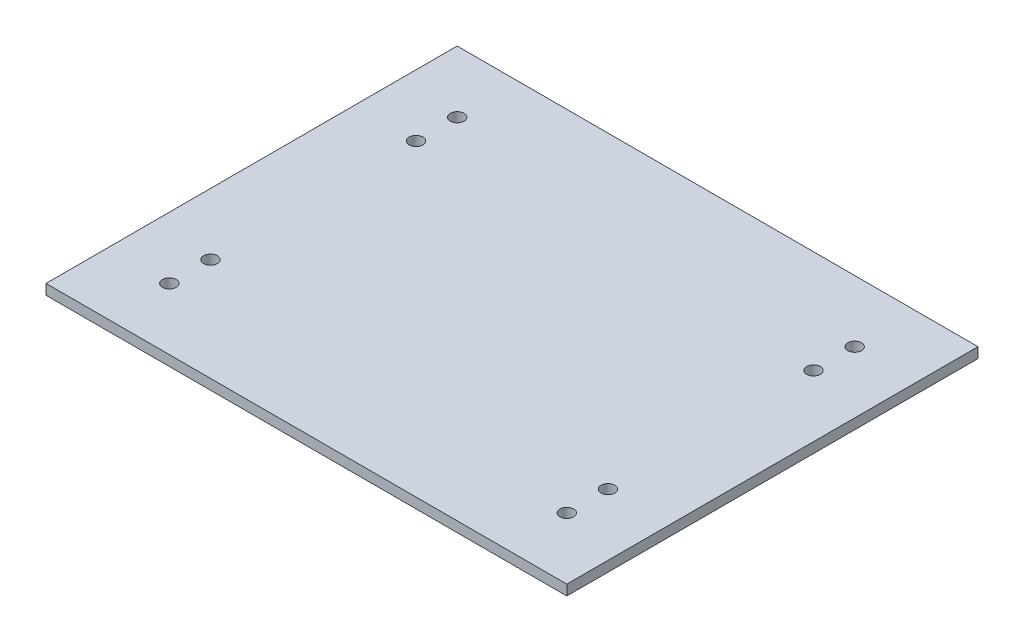
ISO-10303-21;
HEADER;
FILE_DESCRIPTION(('STEP AP214'),'2;1');
FILE_NAME('part.step','',(''),(''),'','','');
FILE_SCHEMA(('AUTOMOTIVE_DESIGN { 1 0 10303 214 1 1 1 1 }'));
ENDSEC;
DATA;
#1=APPLICATION_CONTEXT('core data for automotive mechanical design processes');
#2=APPLICATION_PROTOCOL_DEFINITION('international standard','automotive_design',2000,#1);
#3=PRODUCT_CONTEXT('',#1,'mechanical');
#4=PRODUCT('Part','Part','',(#3));
#5=PRODUCT_RELATED_PRODUCT_CATEGORY('part','',(#4));
#6=PRODUCT_DEFINITION_FORMATION('','',#4);
#7=PRODUCT_DEFINITION_CONTEXT('part definition',#1,'design');
#8=PRODUCT_DEFINITION('design','',#6,#7);
#9=PRODUCT_DEFINITION_SHAPE('','',#8);
#10=(LENGTH_UNIT() NAMED_UNIT(*) SI_UNIT(.MILLI.,.METRE.));
#11=(NAMED_UNIT(*) PLANE_ANGLE_UNIT() SI_UNIT($,.RADIAN.));
#12=(NAMED_UNIT(*) SI_UNIT($,.STERADIAN.) SOLID_ANGLE_UNIT());
#13=UNCERTAINTY_MEASURE_WITH_UNIT(LENGTH_MEASURE(1.E-05),#10,'distance_accuracy_value','');
#14=(GEOMETRIC_REPRESENTATION_CONTEXT(3) GLOBAL_UNCERTAINTY_ASSIGNED_CONTEXT((#13)) GLOBAL_UNIT_ASSIGNED_CONTEXT((#10,
#11,#12)) REPRESENTATION_CONTEXT('',''));
#15=CARTESIAN_POINT('',(0.,0.,0.));
#16=DIRECTION('',(0.,0.,1.));
#17=DIRECTION('',(1.,0.,0.));
#18=AXIS2_PLACEMENT_3D('',#15,#16,#17);
#19=CARTESIAN_POINT('',(-47.0316881728543,3.,-71.8994098232172));
#20=DIRECTION('',(1.,0.,0.));
#21=DIRECTION('',(0.,0.,-1.));
#22=AXIS2_PLACEMENT_3D('',#19,#20,#21);
#23=PLANE('',#22);
#24=DIRECTION('',(0.,0.,1.));
#25=VECTOR('',#24,1.);
#26=CARTESIAN_POINT('',(-47.0316881728543,0.,-71.8994098232172));
#27=LINE('',#26,#25);
#28=CARTESIAN_POINT('',(-47.0316881728543,0.,-71.8994098232172));
#29=VERTEX_POINT('',#28);
#30=CARTESIAN_POINT('',(-47.0316881728543,0.,48.1005901767828));
#31=VERTEX_POINT('',#30);
#32=EDGE_CURVE('E96',#29,#31,#27,.T.);
#33=ORIENTED_EDGE('',*,*,#32,.T.);
#34=DIRECTION('',(0.,-1.,0.));
#35=VECTOR('',#34,1.);
#36=CARTESIAN_POINT('',(-47.0316881728543,3.,48.1005901767828));
#37=LINE('',#36,#35);
#38=CARTESIAN_POINT('',(-47.0316881728543,3.,48.1005901767828));
#39=VERTEX_POINT('',#38);
#40=EDGE_CURVE('E11',#39,#31,#37,.T.);
#41=ORIENTED_EDGE('',*,*,#40,.F.);
#42=DIRECTION('',(0.,0.,1.));
#43=VECTOR('',#42,1.);
#44=CARTESIAN_POINT('',(-47.0316881728543,3.,-71.8994098232172));
#45=LINE('',#44,#43);
#46=CARTESIAN_POINT('',(-47.0316881728543,3.,-71.8994098232172));
#47=VERTEX_POINT('',#46);
#48=EDGE_CURVE('E84',#47,#39,#45,.T.);
#49=ORIENTED_EDGE('',*,*,#48,.F.);
#50=DIRECTION('',(0.,-1.,0.));
#51=VECTOR('',#50,1.);
#52=CARTESIAN_POINT('',(-47.0316881728543,3.,-71.8994098232172));
#53=LINE('',#52,#51);
#54=EDGE_CURVE('E92',#47,#29,#53,.T.);
#55=ORIENTED_EDGE('',*,*,#54,.T.);
#56=EDGE_LOOP('',(#33,#41,#49,#55));
#57=FACE_BOUND('',#56,.T.);
#58=ADVANCED_FACE('F33',(#57),#23,.F.);
#59=CARTESIAN_POINT('',(-47.0316881728543,3.,48.1005901767828));
#60=DIRECTION('',(0.,0.,-1.));
#61=DIRECTION('',(-1.,0.,0.));
#62=AXIS2_PLACEMENT_3D('',#59,#60,#61);
#63=PLANE('',#62);
#64=DIRECTION('',(1.,0.,0.));
#65=VECTOR('',#64,1.);
#66=CARTESIAN_POINT('',(-47.0316881728543,0.,48.1005901767828));
#67=LINE('',#66,#65);
#68=CARTESIAN_POINT('',(104.968311827146,0.,48.1005901767828));
#69=VERTEX_POINT('',#68);
#70=EDGE_CURVE('E88',#31,#69,#67,.T.);
#71=ORIENTED_EDGE('',*,*,#70,.T.);
#72=DIRECTION('',(0.,-1.,0.));
#73=VECTOR('',#72,1.);
#74=CARTESIAN_POINT('',(104.968311827146,3.,48.1005901767828));
#75=LINE('',#74,#73);
#76=CARTESIAN_POINT('',(104.968311827146,3.,48.1005901767828));
#77=VERTEX_POINT('',#76);
#78=EDGE_CURVE('E41',#77,#69,#75,.T.);
#79=ORIENTED_EDGE('',*,*,#78,.F.);
#80=DIRECTION('',(1.,0.,0.));
#81=VECTOR('',#80,1.);
#82=CARTESIAN_POINT('',(-47.0316881728543,3.,48.1005901767828));
#83=LINE('',#82,#81);
#84=EDGE_CURVE('E79',#39,#77,#83,.T.);
#85=ORIENTED_EDGE('',*,*,#84,.F.);
#86=ORIENTED_EDGE('',*,*,#40,.T.);
#87=EDGE_LOOP('',(#71,#79,#85,#86));
#88=FACE_BOUND('',#87,.T.);
#89=ADVANCED_FACE('F87',(#88),#63,.F.);
#90=CARTESIAN_POINT('',(104.968311827146,3.,-71.8994098232172));
#91=DIRECTION('',(-1.,0.,0.));
#92=DIRECTION('',(0.,0.,1.));
#93=AXIS2_PLACEMENT_3D('',#90,#91,#92);
#94=PLANE('',#93);
#95=DIRECTION('',(0.,0.,-1.));
#96=VECTOR('',#95,1.);
#97=CARTESIAN_POINT('',(104.968311827146,0.,-71.8994098232172));
#98=LINE('',#97,#96);
#99=CARTESIAN_POINT('',(104.968311827146,0.,-71.8994098232172));
#100=VERTEX_POINT('',#99);
#101=EDGE_CURVE('E66',#69,#100,#98,.T.);
#102=ORIENTED_EDGE('',*,*,#101,.T.);
#103=DIRECTION('',(0.,-1.,0.));
#104=VECTOR('',#103,1.);
#105=CARTESIAN_POINT('',(104.968311827146,3.,-71.8994098232172));
#106=LINE('',#105,#104);
#107=CARTESIAN_POINT('',(104.968311827146,3.,-71.8994098232172));
#108=VERTEX_POINT('',#107);
#109=EDGE_CURVE('E89',#108,#100,#106,.T.);
#110=ORIENTED_EDGE('',*,*,#109,.F.);
#111=DIRECTION('',(0.,0.,-1.));
#112=VECTOR('',#111,1.);
#113=CARTESIAN_POINT('',(104.968311827146,3.,-71.8994098232172));
#114=LINE('',#113,#112);
#115=EDGE_CURVE('E82',#77,#108,#114,.T.);
#116=ORIENTED_EDGE('',*,*,#115,.F.);
#117=ORIENTED_EDGE('',*,*,#78,.T.);
#118=EDGE_LOOP('',(#102,#110,#116,#117));
#119=FACE_BOUND('',#118,.T.);
#120=ADVANCED_FACE('F90',(#119),#94,.F.);
#121=CARTESIAN_POINT('',(-47.0316881728543,3.,-71.8994098232172));
#122=DIRECTION('',(0.,0.,1.));
#123=DIRECTION('',(1.,0.,0.));
#124=AXIS2_PLACEMENT_3D('',#121,#122,#123);
#125=PLANE('',#124);
#126=DIRECTION('',(-1.,0.,0.));
#127=VECTOR('',#126,1.);
#128=CARTESIAN_POINT('',(-47.0316881728543,0.,-71.8994098232172));
#129=LINE('',#128,#127);
#130=EDGE_CURVE('E72',#100,#29,#129,.T.);
#131=ORIENTED_EDGE('',*,*,#130,.T.);
#132=ORIENTED_EDGE('',*,*,#54,.F.);
#133=DIRECTION('',(-1.,0.,0.));
#134=VECTOR('',#133,1.);
#135=CARTESIAN_POINT('',(-47.0316881728543,3.,-71.8994098232172));
#136=LINE('',#135,#134);
#137=EDGE_CURVE('E49',#108,#47,#136,.T.);
#138=ORIENTED_EDGE('',*,*,#137,.F.);
#139=ORIENTED_EDGE('',*,*,#109,.T.);
#140=EDGE_LOOP('',(#131,#132,#138,#139));
#141=FACE_BOUND('',#140,.T.);
#142=ADVANCED_FACE('F104',(#141),#125,.F.);
#143=CARTESIAN_POINT('',(-47.0316881728543,3.,48.1005901767828));
#144=DIRECTION('',(0.,1.,0.));
#145=DIRECTION('',(0.,0.,1.));
#146=AXIS2_PLACEMENT_3D('',#143,#144,#145);
#147=PLANE('',#146);
#148=CARTESIAN_POINT('',(-29.0316881728543,3.,30.1005901767827));
#149=DIRECTION('',(0.,1.,0.));
#150=DIRECTION('',(0.,0.,1.));
#151=AXIS2_PLACEMENT_3D('',#148,#149,#150);
#152=CIRCLE('',#151,2.);
#153=CARTESIAN_POINT('',(-29.0316881728543,3.,32.1005901767827));
#154=VERTEX_POINT('',#153);
#155=EDGE_CURVE('E152',#154,#154,#152,.T.);
#156=ORIENTED_EDGE('',*,*,#155,.F.);
#157=EDGE_LOOP('',(#156));
#158=FACE_BOUND('',#157,.T.);
#159=CARTESIAN_POINT('',(-29.0316881728543,3.,18.1005901767828));
#160=DIRECTION('',(0.,1.,0.));
#161=DIRECTION('',(0.,0.,1.));
#162=AXIS2_PLACEMENT_3D('',#159,#160,#161);
#163=CIRCLE('',#162,2.);
#164=CARTESIAN_POINT('',(-29.0316881728543,3.,20.1005901767827));
#165=VERTEX_POINT('',#164);
#166=EDGE_CURVE('E146',#165,#165,#163,.T.);
#167=ORIENTED_EDGE('',*,*,#166,.F.);
#168=EDGE_LOOP('',(#167));
#169=FACE_BOUND('',#168,.T.);
#170=CARTESIAN_POINT('',(-29.0316881728543,3.,-41.8994098232172));
#171=DIRECTION('',(0.,1.,0.));
#172=DIRECTION('',(0.,0.,1.));
#173=AXIS2_PLACEMENT_3D('',#170,#171,#172);
#174=CIRCLE('',#173,2.);
#175=CARTESIAN_POINT('',(-29.0316881728543,3.,-39.8994098232172));
#176=VERTEX_POINT('',#175);
#177=EDGE_CURVE('E140',#176,#176,#174,.T.);
#178=ORIENTED_EDGE('',*,*,#177,.F.);
#179=EDGE_LOOP('',(#178));
#180=FACE_BOUND('',#179,.T.);
#181=CARTESIAN_POINT('',(86.9683118271457,3.,-53.8994098232172));
#182=DIRECTION('',(0.,1.,0.));
#183=DIRECTION('',(0.,0.,1.));
#184=AXIS2_PLACEMENT_3D('',#181,#182,#183);
#185=CIRCLE('',#184,2.);
#186=CARTESIAN_POINT('',(86.9683118271457,3.,-51.8994098232172));
#187=VERTEX_POINT('',#186);
#188=EDGE_CURVE('E134',#187,#187,#185,.T.);
#189=ORIENTED_EDGE('',*,*,#188,.F.);
#190=EDGE_LOOP('',(#189));
#191=FACE_BOUND('',#190,.T.);
#192=CARTESIAN_POINT('',(-29.0316881728543,3.,-53.8994098232172));
#193=DIRECTION('',(0.,1.,0.));
#194=DIRECTION('',(0.,0.,1.));
#195=AXIS2_PLACEMENT_3D('',#192,#193,#194);
#196=CIRCLE('',#195,2.00000000000001);
#197=CARTESIAN_POINT('',(-29.0316881728543,3.,-51.8994098232172));
#198=VERTEX_POINT('',#197);
#199=EDGE_CURVE('E128',#198,#198,#196,.T.);
#200=ORIENTED_EDGE('',*,*,#199,.F.);
#201=EDGE_LOOP('',(#200));
#202=FACE_BOUND('',#201,.T.);
#203=CARTESIAN_POINT('',(86.9683118271458,3.,-41.8994098232172));
#204=DIRECTION('',(0.,1.,0.));
#205=DIRECTION('',(0.,0.,1.));
#206=AXIS2_PLACEMENT_3D('',#203,#204,#205);
#207=CIRCLE('',#206,2.);
#208=CARTESIAN_POINT('',(86.9683118271458,3.,-39.8994098232172));
#209=VERTEX_POINT('',#208);
#210=EDGE_CURVE('E122',#209,#209,#207,.T.);
#211=ORIENTED_EDGE('',*,*,#210,.F.);
#212=EDGE_LOOP('',(#211));
#213=FACE_BOUND('',#212,.T.);
#214=CARTESIAN_POINT('',(86.9683118271458,3.,18.1005901767827));
#215=DIRECTION('',(0.,1.,0.));
#216=DIRECTION('',(0.,0.,1.));
#217=AXIS2_PLACEMENT_3D('',#214,#215,#216);
#218=CIRCLE('',#217,2.);
#219=CARTESIAN_POINT('',(86.9683118271458,3.,20.1005901767827));
#220=VERTEX_POINT('',#219);
#221=EDGE_CURVE('E116',#220,#220,#218,.T.);
#222=ORIENTED_EDGE('',*,*,#221,.F.);
#223=EDGE_LOOP('',(#222));
#224=FACE_BOUND('',#223,.T.);
#225=CARTESIAN_POINT('',(86.9683118271457,3.,30.1005901767827));
#226=DIRECTION('',(0.,1.,0.));
#227=DIRECTION('',(0.,0.,1.));
#228=AXIS2_PLACEMENT_3D('',#225,#226,#227);
#229=CIRCLE('',#228,2.);
#230=CARTESIAN_POINT('',(86.9683118271457,3.,32.1005901767827));
#231=VERTEX_POINT('',#230);
#232=EDGE_CURVE('E110',#231,#231,#229,.T.);
#233=ORIENTED_EDGE('',*,*,#232,.F.);
#234=EDGE_LOOP('',(#233));
#235=FACE_BOUND('',#234,.T.);
#236=ORIENTED_EDGE('',*,*,#48,.T.);
#237=ORIENTED_EDGE('',*,*,#84,.T.);
#238=ORIENTED_EDGE('',*,*,#115,.T.);
#239=ORIENTED_EDGE('',*,*,#137,.T.);
#240=EDGE_LOOP('',(#236,#237,#238,#239));
#241=FACE_BOUND('',#240,.T.);
#242=ADVANCED_FACE('F80',(#158,#169,#180,#191,#202,#213,#224,#235,#241),#147,.T.);
#243=CARTESIAN_POINT('',(-47.0316881728543,0.,48.1005901767828));
#244=DIRECTION('',(0.,1.,0.));
#245=DIRECTION('',(0.,0.,1.));
#246=AXIS2_PLACEMENT_3D('',#243,#244,#245);
#247=PLANE('',#246);
#248=CARTESIAN_POINT('',(-29.0316881728543,0.,30.1005901767827));
#249=DIRECTION('',(0.,1.,0.));
#250=DIRECTION('',(0.,0.,1.));
#251=AXIS2_PLACEMENT_3D('',#248,#249,#250);
#252=CIRCLE('',#251,2.);
#253=CARTESIAN_POINT('',(-29.0316881728543,0.,32.1005901767827));
#254=VERTEX_POINT('',#253);
#255=EDGE_CURVE('E149',#254,#254,#252,.T.);
#256=ORIENTED_EDGE('',*,*,#255,.T.);
#257=EDGE_LOOP('',(#256));
#258=FACE_BOUND('',#257,.T.);
#259=CARTESIAN_POINT('',(-29.0316881728543,0.,18.1005901767828));
#260=DIRECTION('',(0.,1.,0.));
#261=DIRECTION('',(0.,0.,1.));
#262=AXIS2_PLACEMENT_3D('',#259,#260,#261);
#263=CIRCLE('',#262,2.);
#264=CARTESIAN_POINT('',(-29.0316881728543,0.,20.1005901767827));
#265=VERTEX_POINT('',#264);
#266=EDGE_CURVE('E143',#265,#265,#263,.T.);
#267=ORIENTED_EDGE('',*,*,#266,.T.);
#268=EDGE_LOOP('',(#267));
#269=FACE_BOUND('',#268,.T.);
#270=CARTESIAN_POINT('',(-29.0316881728543,0.,-41.8994098232172));
#271=DIRECTION('',(0.,1.,0.));
#272=DIRECTION('',(0.,0.,1.));
#273=AXIS2_PLACEMENT_3D('',#270,#271,#272);
#274=CIRCLE('',#273,2.);
#275=CARTESIAN_POINT('',(-29.0316881728543,0.,-39.8994098232172));
#276=VERTEX_POINT('',#275);
#277=EDGE_CURVE('E137',#276,#276,#274,.T.);
#278=ORIENTED_EDGE('',*,*,#277,.T.);
#279=EDGE_LOOP('',(#278));
#280=FACE_BOUND('',#279,.T.);
#281=CARTESIAN_POINT('',(86.9683118271457,0.,-53.8994098232172));
#282=DIRECTION('',(0.,1.,0.));
#283=DIRECTION('',(0.,0.,1.));
#284=AXIS2_PLACEMENT_3D('',#281,#282,#283);
#285=CIRCLE('',#284,2.);
#286=CARTESIAN_POINT('',(86.9683118271457,0.,-51.8994098232172));
#287=VERTEX_POINT('',#286);
#288=EDGE_CURVE('E131',#287,#287,#285,.T.);
#289=ORIENTED_EDGE('',*,*,#288,.T.);
#290=EDGE_LOOP('',(#289));
#291=FACE_BOUND('',#290,.T.);
#292=CARTESIAN_POINT('',(-29.0316881728543,0.,-53.8994098232172));
#293=DIRECTION('',(0.,1.,0.));
#294=DIRECTION('',(0.,0.,1.));
#295=AXIS2_PLACEMENT_3D('',#292,#293,#294);
#296=CIRCLE('',#295,2.00000000000001);
#297=CARTESIAN_POINT('',(-29.0316881728543,0.,-51.8994098232172));
#298=VERTEX_POINT('',#297);
#299=EDGE_CURVE('E125',#298,#298,#296,.T.);
#300=ORIENTED_EDGE('',*,*,#299,.T.);
#301=EDGE_LOOP('',(#300));
#302=FACE_BOUND('',#301,.T.);
#303=CARTESIAN_POINT('',(86.9683118271458,0.,-41.8994098232172));
#304=DIRECTION('',(0.,1.,0.));
#305=DIRECTION('',(0.,0.,1.));
#306=AXIS2_PLACEMENT_3D('',#303,#304,#305);
#307=CIRCLE('',#306,2.);
#308=CARTESIAN_POINT('',(86.9683118271458,0.,-39.8994098232172));
#309=VERTEX_POINT('',#308);
#310=EDGE_CURVE('E119',#309,#309,#307,.T.);
#311=ORIENTED_EDGE('',*,*,#310,.T.);
#312=EDGE_LOOP('',(#311));
#313=FACE_BOUND('',#312,.T.);
#314=CARTESIAN_POINT('',(86.9683118271458,0.,18.1005901767827));
#315=DIRECTION('',(0.,1.,0.));
#316=DIRECTION('',(0.,0.,1.));
#317=AXIS2_PLACEMENT_3D('',#314,#315,#316);
#318=CIRCLE('',#317,2.);
#319=CARTESIAN_POINT('',(86.9683118271458,0.,20.1005901767827));
#320=VERTEX_POINT('',#319);
#321=EDGE_CURVE('E113',#320,#320,#318,.T.);
#322=ORIENTED_EDGE('',*,*,#321,.T.);
#323=EDGE_LOOP('',(#322));
#324=FACE_BOUND('',#323,.T.);
#325=CARTESIAN_POINT('',(86.9683118271457,0.,30.1005901767827));
#326=DIRECTION('',(0.,1.,0.));
#327=DIRECTION('',(0.,0.,1.));
#328=AXIS2_PLACEMENT_3D('',#325,#326,#327);
#329=CIRCLE('',#328,2.);
#330=CARTESIAN_POINT('',(86.9683118271457,0.,32.1005901767827));
#331=VERTEX_POINT('',#330);
#332=EDGE_CURVE('E99',#331,#331,#329,.T.);
#333=ORIENTED_EDGE('',*,*,#332,.T.);
#334=EDGE_LOOP('',(#333));
#335=FACE_BOUND('',#334,.T.);
#336=ORIENTED_EDGE('',*,*,#32,.F.);
#337=ORIENTED_EDGE('',*,*,#130,.F.);
#338=ORIENTED_EDGE('',*,*,#101,.F.);
#339=ORIENTED_EDGE('',*,*,#70,.F.);
#340=EDGE_LOOP('',(#336,#337,#338,#339));
#341=FACE_BOUND('',#340,.T.);
#342=ADVANCED_FACE('F107',(#258,#269,#280,#291,#302,#313,#324,#335,#341),#247,.F.);
#343=CARTESIAN_POINT('',(86.9683118271457,0.,30.1005901767827));
#344=DIRECTION('',(0.,1.,0.));
#345=DIRECTION('',(0.,0.,1.));
#346=AXIS2_PLACEMENT_3D('',#343,#344,#345);
#347=CYLINDRICAL_SURFACE('',#346,2.);
#348=ORIENTED_EDGE('',*,*,#332,.F.);
#349=EDGE_LOOP('',(#348));
#350=FACE_BOUND('',#349,.T.);
#351=ORIENTED_EDGE('',*,*,#232,.T.);
#352=EDGE_LOOP('',(#351));
#353=FACE_BOUND('',#352,.T.);
#354=ADVANCED_FACE('F184',(#350,#353),#347,.F.);
#355=CARTESIAN_POINT('',(86.9683118271458,0.,18.1005901767827));
#356=DIRECTION('',(0.,1.,0.));
#357=DIRECTION('',(0.,0.,1.));
#358=AXIS2_PLACEMENT_3D('',#355,#356,#357);
#359=CYLINDRICAL_SURFACE('',#358,2.);
#360=ORIENTED_EDGE('',*,*,#321,.F.);
#361=EDGE_LOOP('',(#360));
#362=FACE_BOUND('',#361,.T.);
#363=ORIENTED_EDGE('',*,*,#221,.T.);
#364=EDGE_LOOP('',(#363));
#365=FACE_BOUND('',#364,.T.);
#366=ADVANCED_FACE('F186',(#362,#365),#359,.F.);
#367=CARTESIAN_POINT('',(86.9683118271458,0.,-41.8994098232172));
#368=DIRECTION('',(0.,1.,0.));
#369=DIRECTION('',(0.,0.,1.));
#370=AXIS2_PLACEMENT_3D('',#367,#368,#369);
#371=CYLINDRICAL_SURFACE('',#370,2.);
#372=ORIENTED_EDGE('',*,*,#310,.F.);
#373=EDGE_LOOP('',(#372));
#374=FACE_BOUND('',#373,.T.);
#375=ORIENTED_EDGE('',*,*,#210,.T.);
#376=EDGE_LOOP('',(#375));
#377=FACE_BOUND('',#376,.T.);
#378=ADVANCED_FACE('F193',(#374,#377),#371,.F.);
#379=CARTESIAN_POINT('',(-29.0316881728543,0.,-53.8994098232172));
#380=DIRECTION('',(0.,1.,0.));
#381=DIRECTION('',(0.,0.,1.));
#382=AXIS2_PLACEMENT_3D('',#379,#380,#381);
#383=CYLINDRICAL_SURFACE('',#382,2.00000000000001);
#384=ORIENTED_EDGE('',*,*,#299,.F.);
#385=EDGE_LOOP('',(#384));
#386=FACE_BOUND('',#385,.T.);
#387=ORIENTED_EDGE('',*,*,#199,.T.);
#388=EDGE_LOOP('',(#387));
#389=FACE_BOUND('',#388,.T.);
#390=ADVANCED_FACE('F231',(#386,#389),#383,.F.);
#391=CARTESIAN_POINT('',(86.9683118271457,0.,-53.8994098232172));
#392=DIRECTION('',(0.,1.,0.));
#393=DIRECTION('',(0.,0.,1.));
#394=AXIS2_PLACEMENT_3D('',#391,#392,#393);
#395=CYLINDRICAL_SURFACE('',#394,2.);
#396=ORIENTED_EDGE('',*,*,#288,.F.);
#397=EDGE_LOOP('',(#396));
#398=FACE_BOUND('',#397,.T.);
#399=ORIENTED_EDGE('',*,*,#188,.T.);
#400=EDGE_LOOP('',(#399));
#401=FACE_BOUND('',#400,.T.);
#402=ADVANCED_FACE('F242',(#398,#401),#395,.F.);
#403=CARTESIAN_POINT('',(-29.0316881728543,0.,-41.8994098232172));
#404=DIRECTION('',(0.,1.,0.));
#405=DIRECTION('',(0.,0.,1.));
#406=AXIS2_PLACEMENT_3D('',#403,#404,#405);
#407=CYLINDRICAL_SURFACE('',#406,2.);
#408=ORIENTED_EDGE('',*,*,#277,.F.);
#409=EDGE_LOOP('',(#408));
#410=FACE_BOUND('',#409,.T.);
#411=ORIENTED_EDGE('',*,*,#177,.T.);
#412=EDGE_LOOP('',(#411));
#413=FACE_BOUND('',#412,.T.);
#414=ADVANCED_FACE('F252',(#410,#413),#407,.F.);
#415=CARTESIAN_POINT('',(-29.0316881728543,0.,18.1005901767828));
#416=DIRECTION('',(0.,1.,0.));
#417=DIRECTION('',(0.,0.,1.));
#418=AXIS2_PLACEMENT_3D('',#415,#416,#417);
#419=CYLINDRICAL_SURFACE('',#418,2.);
#420=ORIENTED_EDGE('',*,*,#266,.F.);
#421=EDGE_LOOP('',(#420));
#422=FACE_BOUND('',#421,.T.);
#423=ORIENTED_EDGE('',*,*,#166,.T.);
#424=EDGE_LOOP('',(#423));
#425=FACE_BOUND('',#424,.T.);
#426=ADVANCED_FACE('F163',(#422,#425),#419,.F.);
#427=CARTESIAN_POINT('',(-29.0316881728543,0.,30.1005901767827));
#428=DIRECTION('',(0.,1.,0.));
#429=DIRECTION('',(0.,0.,1.));
#430=AXIS2_PLACEMENT_3D('',#427,#428,#429);
#431=CYLINDRICAL_SURFACE('',#430,2.);
#432=ORIENTED_EDGE('',*,*,#255,.F.);
#433=EDGE_LOOP('',(#432));
#434=FACE_BOUND('',#433,.T.);
#435=ORIENTED_EDGE('',*,*,#155,.T.);
#436=EDGE_LOOP('',(#435));
#437=FACE_BOUND('',#436,.T.);
#438=ADVANCED_FACE('F160',(#434,#437),#431,.F.);
#439=CLOSED_SHELL('',(#58,#89,#120,#142,#242,#342,#354,#366,#378,#390,#402,#414,#426,#438));
#440=MANIFOLD_SOLID_BREP('B2',#439);
#441=ADVANCED_BREP_SHAPE_REPRESENTATION('',(#18,#440),#14);
#442=SHAPE_DEFINITION_REPRESENTATION(#9,#441);
ENDSEC;
END-ISO-10303-21;
